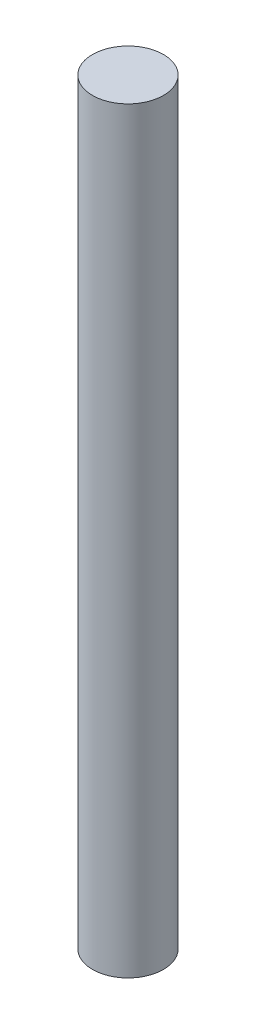
ISO-10303-21;
HEADER;
FILE_DESCRIPTION(('STEP AP214'),'2;1');
FILE_NAME('part.step','',(''),(''),'','','');
FILE_SCHEMA(('AUTOMOTIVE_DESIGN { 1 0 10303 214 1 1 1 1 }'));
ENDSEC;
DATA;
#1=APPLICATION_CONTEXT('core data for automotive mechanical design processes');
#2=APPLICATION_PROTOCOL_DEFINITION('international standard','automotive_design',2000,#1);
#3=PRODUCT_CONTEXT('',#1,'mechanical');
#4=PRODUCT('Part','Part','',(#3));
#5=PRODUCT_RELATED_PRODUCT_CATEGORY('part','',(#4));
#6=PRODUCT_DEFINITION_FORMATION('','',#4);
#7=PRODUCT_DEFINITION_CONTEXT('part definition',#1,'design');
#8=PRODUCT_DEFINITION('design','',#6,#7);
#9=PRODUCT_DEFINITION_SHAPE('','',#8);
#10=(LENGTH_UNIT() NAMED_UNIT(*) SI_UNIT(.MILLI.,.METRE.));
#11=(NAMED_UNIT(*) PLANE_ANGLE_UNIT() SI_UNIT($,.RADIAN.));
#12=(NAMED_UNIT(*) SI_UNIT($,.STERADIAN.) SOLID_ANGLE_UNIT());
#13=UNCERTAINTY_MEASURE_WITH_UNIT(LENGTH_MEASURE(1.E-05),#10,'distance_accuracy_value','');
#14=(GEOMETRIC_REPRESENTATION_CONTEXT(3) GLOBAL_UNCERTAINTY_ASSIGNED_CONTEXT((#13)) GLOBAL_UNIT_ASSIGNED_CONTEXT((#10,
#11,#12)) REPRESENTATION_CONTEXT('',''));
#15=CARTESIAN_POINT('',(0.,0.,0.));
#16=DIRECTION('',(0.,0.,1.));
#17=DIRECTION('',(1.,0.,0.));
#18=AXIS2_PLACEMENT_3D('',#15,#16,#17);
#19=CARTESIAN_POINT('',(-1.50000000000002,-32.,0.));
#20=DIRECTION('',(0.,-1.,0.));
#21=DIRECTION('',(1.,0.,0.));
#22=AXIS2_PLACEMENT_3D('',#19,#20,#21);
#23=PLANE('',#22);
#24=DIRECTION('',(0.,0.,1.));
#25=VECTOR('',#24,1.);
#26=CARTESIAN_POINT('',(-1.00000000000002,-32.,-1.11803398874989));
#27=LINE('',#26,#25);
#28=CARTESIAN_POINT('',(-1.00000000000002,-32.,-1.11803398874989));
#29=VERTEX_POINT('',#28);
#30=CARTESIAN_POINT('',(-1.00000000000002,-32.,1.11803398874989));
#31=VERTEX_POINT('',#30);
#32=EDGE_CURVE('E67',#29,#31,#27,.T.);
#33=ORIENTED_EDGE('',*,*,#32,.F.);
#34=CARTESIAN_POINT('',(0.,-32.,0.));
#35=DIRECTION('',(0.,1.,0.));
#36=DIRECTION('',(-1.,0.,0.));
#37=AXIS2_PLACEMENT_3D('',#34,#35,#36);
#38=CIRCLE('',#37,1.5);
#39=EDGE_CURVE('E11',#31,#29,#38,.T.);
#40=ORIENTED_EDGE('',*,*,#39,.F.);
#41=EDGE_LOOP('',(#33,#40));
#42=FACE_BOUND('',#41,.T.);
#43=ADVANCED_FACE('F39',(#42),#23,.T.);
#44=CARTESIAN_POINT('',(0.,0.,0.));
#45=DIRECTION('',(0.,1.,0.));
#46=DIRECTION('',(-1.,0.,0.));
#47=AXIS2_PLACEMENT_3D('',#44,#45,#46);
#48=CYLINDRICAL_SURFACE('',#47,1.5);
#49=DIRECTION('',(0.,-1.,0.));
#50=VECTOR('',#49,1.);
#51=CARTESIAN_POINT('',(-1.00000000000002,-22.7,-1.11803398874989));
#52=LINE('',#51,#50);
#53=CARTESIAN_POINT('',(-1.00000000000002,-22.7,-1.11803398874989));
#54=VERTEX_POINT('',#53);
#55=EDGE_CURVE('E64',#54,#29,#52,.T.);
#56=ORIENTED_EDGE('',*,*,#55,.F.);
#57=CARTESIAN_POINT('',(0.,-22.7,0.));
#58=DIRECTION('',(0.,-1.,0.));
#59=DIRECTION('',(1.,0.,0.));
#60=AXIS2_PLACEMENT_3D('',#57,#58,#59);
#61=CIRCLE('',#60,1.5);
#62=CARTESIAN_POINT('',(-1.00000000000002,-22.7,1.11803398874989));
#63=VERTEX_POINT('',#62);
#64=EDGE_CURVE('E57',#63,#54,#61,.T.);
#65=ORIENTED_EDGE('',*,*,#64,.F.);
#66=DIRECTION('',(0.,-1.,0.));
#67=VECTOR('',#66,1.);
#68=CARTESIAN_POINT('',(-1.00000000000002,-22.7,1.11803398874989));
#69=LINE('',#68,#67);
#70=EDGE_CURVE('E70',#63,#31,#69,.T.);
#71=ORIENTED_EDGE('',*,*,#70,.T.);
#72=ORIENTED_EDGE('',*,*,#39,.T.);
#73=EDGE_LOOP('',(#56,#65,#71,#72));
#74=FACE_BOUND('',#73,.T.);
#75=CARTESIAN_POINT('',(0.,0.,0.));
#76=DIRECTION('',(0.,1.,0.));
#77=DIRECTION('',(-1.,0.,0.));
#78=AXIS2_PLACEMENT_3D('',#75,#76,#77);
#79=CIRCLE('',#78,1.5);
#80=CARTESIAN_POINT('',(-1.5,0.,0.));
#81=VERTEX_POINT('',#80);
#82=EDGE_CURVE('E46',#81,#81,#79,.T.);
#83=ORIENTED_EDGE('',*,*,#82,.F.);
#84=EDGE_LOOP('',(#83));
#85=FACE_BOUND('',#84,.T.);
#86=ADVANCED_FACE('F75',(#74,#85),#48,.T.);
#87=CARTESIAN_POINT('',(0.,0.,0.));
#88=DIRECTION('',(0.,1.,0.));
#89=DIRECTION('',(-1.,0.,0.));
#90=AXIS2_PLACEMENT_3D('',#87,#88,#89);
#91=PLANE('',#90);
#92=ORIENTED_EDGE('',*,*,#82,.T.);
#93=EDGE_LOOP('',(#92));
#94=FACE_BOUND('',#93,.T.);
#95=ADVANCED_FACE('F83',(#94),#91,.T.);
#96=CARTESIAN_POINT('',(-1.00000000000002,-22.7,-1.11803398874989));
#97=DIRECTION('',(1.,0.,0.));
#98=DIRECTION('',(0.,1.,0.));
#99=AXIS2_PLACEMENT_3D('',#96,#97,#98);
#100=PLANE('',#99);
#101=ORIENTED_EDGE('',*,*,#32,.T.);
#102=ORIENTED_EDGE('',*,*,#70,.F.);
#103=DIRECTION('',(0.,0.,1.));
#104=VECTOR('',#103,1.);
#105=CARTESIAN_POINT('',(-1.00000000000002,-22.7,-1.11803398874989));
#106=LINE('',#105,#104);
#107=EDGE_CURVE('E52',#54,#63,#106,.T.);
#108=ORIENTED_EDGE('',*,*,#107,.F.);
#109=ORIENTED_EDGE('',*,*,#55,.T.);
#110=EDGE_LOOP('',(#101,#102,#108,#109));
#111=FACE_BOUND('',#110,.T.);
#112=ADVANCED_FACE('F66',(#111),#100,.F.);
#113=CARTESIAN_POINT('',(0.,-22.7,0.));
#114=DIRECTION('',(0.,-1.,0.));
#115=DIRECTION('',(1.,0.,0.));
#116=AXIS2_PLACEMENT_3D('',#113,#114,#115);
#117=PLANE('',#116);
#118=ORIENTED_EDGE('',*,*,#64,.T.);
#119=ORIENTED_EDGE('',*,*,#107,.T.);
#120=EDGE_LOOP('',(#118,#119));
#121=FACE_BOUND('',#120,.T.);
#122=ADVANCED_FACE('F93',(#121),#117,.T.);
#123=CLOSED_SHELL('',(#43,#86,#95,#112,#122));
#124=MANIFOLD_SOLID_BREP('B2',#123);
#125=ADVANCED_BREP_SHAPE_REPRESENTATION('',(#18,#124),#14);
#126=SHAPE_DEFINITION_REPRESENTATION(#9,#125);
ENDSEC;
END-ISO-10303-21;
